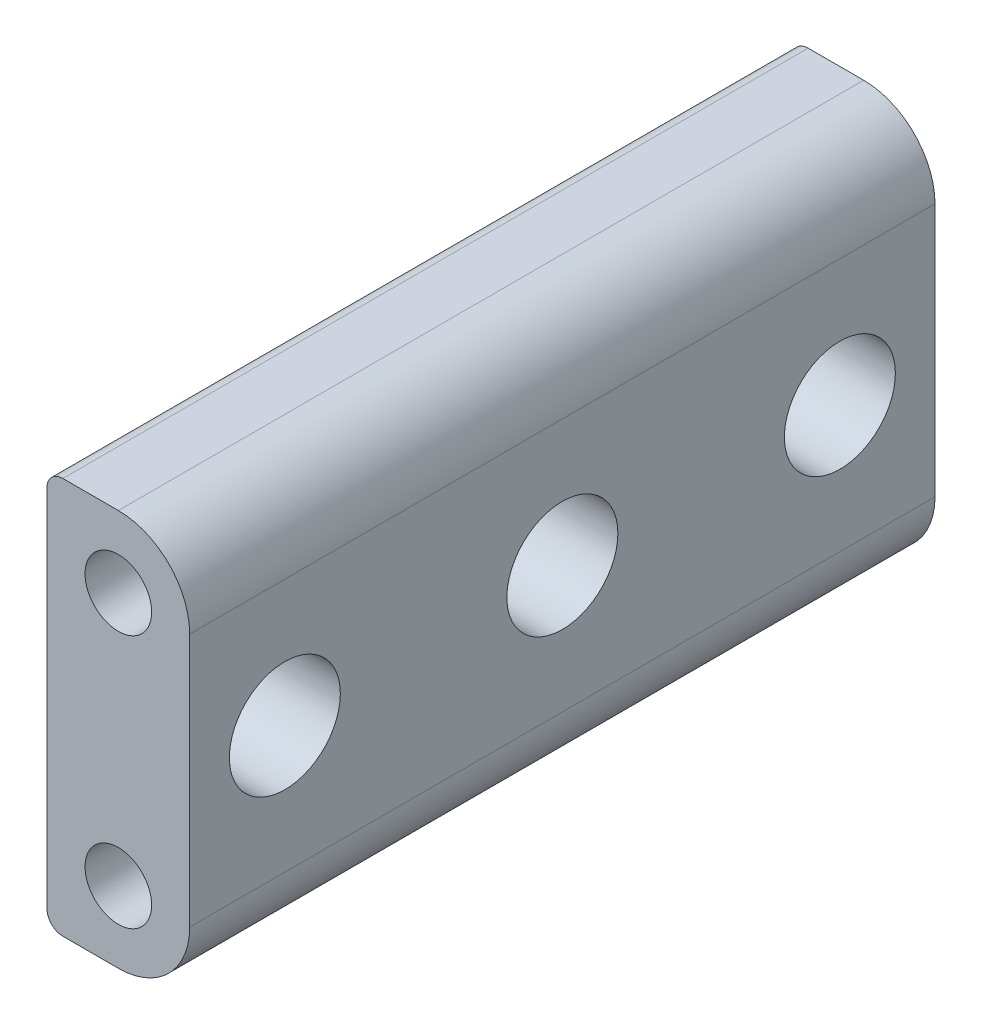
ISO-10303-21;
HEADER;
FILE_DESCRIPTION(('STEP AP214'),'2;1');
FILE_NAME('part.step','',(''),(''),'','','');
FILE_SCHEMA(('AUTOMOTIVE_DESIGN { 1 0 10303 214 1 1 1 1 }'));
ENDSEC;
DATA;
#1=APPLICATION_CONTEXT('core data for automotive mechanical design processes');
#2=APPLICATION_PROTOCOL_DEFINITION('international standard','automotive_design',2000,#1);
#3=PRODUCT_CONTEXT('',#1,'mechanical');
#4=PRODUCT('Part','Part','',(#3));
#5=PRODUCT_RELATED_PRODUCT_CATEGORY('part','',(#4));
#6=PRODUCT_DEFINITION_FORMATION('','',#4);
#7=PRODUCT_DEFINITION_CONTEXT('part definition',#1,'design');
#8=PRODUCT_DEFINITION('design','',#6,#7);
#9=PRODUCT_DEFINITION_SHAPE('','',#8);
#10=(LENGTH_UNIT() NAMED_UNIT(*) SI_UNIT(.MILLI.,.METRE.));
#11=(NAMED_UNIT(*) PLANE_ANGLE_UNIT() SI_UNIT($,.RADIAN.));
#12=(NAMED_UNIT(*) SI_UNIT($,.STERADIAN.) SOLID_ANGLE_UNIT());
#13=UNCERTAINTY_MEASURE_WITH_UNIT(LENGTH_MEASURE(1.E-05),#10,'distance_accuracy_value','');
#14=(GEOMETRIC_REPRESENTATION_CONTEXT(3) GLOBAL_UNCERTAINTY_ASSIGNED_CONTEXT((#13)) GLOBAL_UNIT_ASSIGNED_CONTEXT((#10,
#11,#12)) REPRESENTATION_CONTEXT('',''));
#15=CARTESIAN_POINT('',(0.,0.,0.));
#16=DIRECTION('',(0.,0.,1.));
#17=DIRECTION('',(1.,0.,0.));
#18=AXIS2_PLACEMENT_3D('',#15,#16,#17);
#19=CARTESIAN_POINT('',(0.,16.,47.));
#20=DIRECTION('',(0.,0.,-1.));
#21=DIRECTION('',(-1.,0.,0.));
#22=AXIS2_PLACEMENT_3D('',#19,#20,#21);
#23=CYLINDRICAL_SURFACE('',#22,4.5);
#24=CARTESIAN_POINT('',(0.,16.,0.));
#25=DIRECTION('',(0.,0.,1.));
#26=DIRECTION('',(-1.,0.,0.));
#27=AXIS2_PLACEMENT_3D('',#24,#25,#26);
#28=CIRCLE('',#27,4.5);
#29=CARTESIAN_POINT('',(4.5,16.,0.));
#30=VERTEX_POINT('',#29);
#31=CARTESIAN_POINT('',(0.,20.5,0.));
#32=VERTEX_POINT('',#31);
#33=EDGE_CURVE('E126',#30,#32,#28,.T.);
#34=ORIENTED_EDGE('',*,*,#33,.T.);
#35=DIRECTION('',(0.,0.,-1.));
#36=VECTOR('',#35,1.);
#37=CARTESIAN_POINT('',(0.,20.5,47.));
#38=LINE('',#37,#36);
#39=CARTESIAN_POINT('',(0.,20.5,47.));
#40=VERTEX_POINT('',#39);
#41=EDGE_CURVE('E109',#40,#32,#38,.T.);
#42=ORIENTED_EDGE('',*,*,#41,.F.);
#43=CARTESIAN_POINT('',(0.,16.,47.));
#44=DIRECTION('',(0.,0.,1.));
#45=DIRECTION('',(-1.,0.,0.));
#46=AXIS2_PLACEMENT_3D('',#43,#44,#45);
#47=CIRCLE('',#46,4.5);
#48=CARTESIAN_POINT('',(4.5,16.,47.));
#49=VERTEX_POINT('',#48);
#50=EDGE_CURVE('E114',#49,#40,#47,.T.);
#51=ORIENTED_EDGE('',*,*,#50,.F.);
#52=DIRECTION('',(0.,0.,-1.));
#53=VECTOR('',#52,1.);
#54=CARTESIAN_POINT('',(4.5,16.,47.));
#55=LINE('',#54,#53);
#56=EDGE_CURVE('E176',#49,#30,#55,.T.);
#57=ORIENTED_EDGE('',*,*,#56,.T.);
#58=EDGE_LOOP('',(#34,#42,#51,#57));
#59=FACE_BOUND('',#58,.T.);
#60=ADVANCED_FACE('F41',(#59),#23,.T.);
#61=CARTESIAN_POINT('',(0.,20.5,47.));
#62=DIRECTION('',(0.,-1.,0.));
#63=DIRECTION('',(0.,0.,-1.));
#64=AXIS2_PLACEMENT_3D('',#61,#62,#63);
#65=PLANE('',#64);
#66=DIRECTION('',(-1.,0.,0.));
#67=VECTOR('',#66,1.);
#68=CARTESIAN_POINT('',(0.,20.5,0.));
#69=LINE('',#68,#67);
#70=CARTESIAN_POINT('',(-3.5,20.5,0.));
#71=VERTEX_POINT('',#70);
#72=EDGE_CURVE('E167',#32,#71,#69,.T.);
#73=ORIENTED_EDGE('',*,*,#72,.T.);
#74=DIRECTION('',(0.,0.,-1.));
#75=VECTOR('',#74,1.);
#76=CARTESIAN_POINT('',(-3.5,20.5,47.));
#77=LINE('',#76,#75);
#78=CARTESIAN_POINT('',(-3.5,20.5,47.));
#79=VERTEX_POINT('',#78);
#80=EDGE_CURVE('E12',#71,#79,#77,.F.);
#81=ORIENTED_EDGE('',*,*,#80,.T.);
#82=DIRECTION('',(-1.,0.,0.));
#83=VECTOR('',#82,1.);
#84=CARTESIAN_POINT('',(0.,20.5,47.));
#85=LINE('',#84,#83);
#86=EDGE_CURVE('E105',#40,#79,#85,.T.);
#87=ORIENTED_EDGE('',*,*,#86,.F.);
#88=ORIENTED_EDGE('',*,*,#41,.T.);
#89=EDGE_LOOP('',(#73,#81,#87,#88));
#90=FACE_BOUND('',#89,.T.);
#91=ADVANCED_FACE('F107',(#90),#65,.F.);
#92=CARTESIAN_POINT('',(-4.5,-4.5,47.));
#93=DIRECTION('',(1.,0.,0.));
#94=DIRECTION('',(0.,0.,-1.));
#95=AXIS2_PLACEMENT_3D('',#92,#93,#94);
#96=PLANE('',#95);
#97=DIRECTION('',(0.,-1.,0.));
#98=VECTOR('',#97,1.);
#99=CARTESIAN_POINT('',(-4.5,-4.5,0.));
#100=LINE('',#99,#98);
#101=CARTESIAN_POINT('',(-4.5,19.5,0.));
#102=VERTEX_POINT('',#101);
#103=CARTESIAN_POINT('',(-4.5,-3.5,0.));
#104=VERTEX_POINT('',#103);
#105=EDGE_CURVE('E162',#102,#104,#100,.T.);
#106=ORIENTED_EDGE('',*,*,#105,.T.);
#107=DIRECTION('',(0.,0.,-1.));
#108=VECTOR('',#107,1.);
#109=CARTESIAN_POINT('',(-4.5,-3.5,47.));
#110=LINE('',#109,#108);
#111=CARTESIAN_POINT('',(-4.5,-3.5,47.));
#112=VERTEX_POINT('',#111);
#113=EDGE_CURVE('E62',#104,#112,#110,.F.);
#114=ORIENTED_EDGE('',*,*,#113,.T.);
#115=DIRECTION('',(0.,-1.,0.));
#116=VECTOR('',#115,1.);
#117=CARTESIAN_POINT('',(-4.5,-4.5,47.));
#118=LINE('',#117,#116);
#119=CARTESIAN_POINT('',(-4.5,19.5,47.));
#120=VERTEX_POINT('',#119);
#121=EDGE_CURVE('E113',#120,#112,#118,.T.);
#122=ORIENTED_EDGE('',*,*,#121,.F.);
#123=DIRECTION('',(0.,0.,-1.));
#124=VECTOR('',#123,1.);
#125=CARTESIAN_POINT('',(-4.5,19.5,47.));
#126=LINE('',#125,#124);
#127=EDGE_CURVE('E141',#120,#102,#126,.T.);
#128=ORIENTED_EDGE('',*,*,#127,.T.);
#129=EDGE_LOOP('',(#106,#114,#122,#128));
#130=FACE_BOUND('',#129,.T.);
#131=ADVANCED_FACE('F165',(#130),#96,.F.);
#132=CARTESIAN_POINT('',(0.,-4.5,47.));
#133=DIRECTION('',(0.,1.,0.));
#134=DIRECTION('',(0.,0.,1.));
#135=AXIS2_PLACEMENT_3D('',#132,#133,#134);
#136=PLANE('',#135);
#137=DIRECTION('',(1.,0.,0.));
#138=VECTOR('',#137,1.);
#139=CARTESIAN_POINT('',(0.,-4.5,47.));
#140=LINE('',#139,#138);
#141=CARTESIAN_POINT('',(-3.5,-4.5,47.));
#142=VERTEX_POINT('',#141);
#143=CARTESIAN_POINT('',(0.,-4.5,47.));
#144=VERTEX_POINT('',#143);
#145=EDGE_CURVE('E148',#142,#144,#140,.T.);
#146=ORIENTED_EDGE('',*,*,#145,.F.);
#147=DIRECTION('',(0.,0.,-1.));
#148=VECTOR('',#147,1.);
#149=CARTESIAN_POINT('',(-3.5,-4.5,47.));
#150=LINE('',#149,#148);
#151=CARTESIAN_POINT('',(-3.5,-4.5,0.));
#152=VERTEX_POINT('',#151);
#153=EDGE_CURVE('E127',#142,#152,#150,.T.);
#154=ORIENTED_EDGE('',*,*,#153,.T.);
#155=DIRECTION('',(1.,0.,0.));
#156=VECTOR('',#155,1.);
#157=CARTESIAN_POINT('',(0.,-4.5,0.));
#158=LINE('',#157,#156);
#159=CARTESIAN_POINT('',(0.,-4.5,0.));
#160=VERTEX_POINT('',#159);
#161=EDGE_CURVE('E164',#152,#160,#158,.T.);
#162=ORIENTED_EDGE('',*,*,#161,.T.);
#163=DIRECTION('',(0.,0.,-1.));
#164=VECTOR('',#163,1.);
#165=CARTESIAN_POINT('',(0.,-4.5,47.));
#166=LINE('',#165,#164);
#167=EDGE_CURVE('E128',#144,#160,#166,.T.);
#168=ORIENTED_EDGE('',*,*,#167,.F.);
#169=EDGE_LOOP('',(#146,#154,#162,#168));
#170=FACE_BOUND('',#169,.T.);
#171=ADVANCED_FACE('F153',(#170),#136,.F.);
#172=CARTESIAN_POINT('',(0.,0.,47.));
#173=DIRECTION('',(0.,0.,-1.));
#174=DIRECTION('',(-1.,0.,0.));
#175=AXIS2_PLACEMENT_3D('',#172,#173,#174);
#176=CYLINDRICAL_SURFACE('',#175,4.5);
#177=CARTESIAN_POINT('',(0.,0.,0.));
#178=DIRECTION('',(0.,0.,1.));
#179=DIRECTION('',(1.,0.,0.));
#180=AXIS2_PLACEMENT_3D('',#177,#178,#179);
#181=CIRCLE('',#180,4.5);
#182=CARTESIAN_POINT('',(4.5,0.,0.));
#183=VERTEX_POINT('',#182);
#184=EDGE_CURVE('E169',#160,#183,#181,.T.);
#185=ORIENTED_EDGE('',*,*,#184,.T.);
#186=DIRECTION('',(0.,0.,-1.));
#187=VECTOR('',#186,1.);
#188=CARTESIAN_POINT('',(4.5,0.,47.));
#189=LINE('',#188,#187);
#190=CARTESIAN_POINT('',(4.5,0.,47.));
#191=VERTEX_POINT('',#190);
#192=EDGE_CURVE('E134',#191,#183,#189,.T.);
#193=ORIENTED_EDGE('',*,*,#192,.F.);
#194=CARTESIAN_POINT('',(0.,0.,47.));
#195=DIRECTION('',(0.,0.,1.));
#196=DIRECTION('',(1.,0.,0.));
#197=AXIS2_PLACEMENT_3D('',#194,#195,#196);
#198=CIRCLE('',#197,4.5);
#199=EDGE_CURVE('E156',#144,#191,#198,.T.);
#200=ORIENTED_EDGE('',*,*,#199,.F.);
#201=ORIENTED_EDGE('',*,*,#167,.T.);
#202=EDGE_LOOP('',(#185,#193,#200,#201));
#203=FACE_BOUND('',#202,.T.);
#204=ADVANCED_FACE('F241',(#203),#176,.T.);
#205=CARTESIAN_POINT('',(4.5,0.,47.));
#206=DIRECTION('',(-1.,0.,0.));
#207=DIRECTION('',(0.,0.,1.));
#208=AXIS2_PLACEMENT_3D('',#205,#206,#207);
#209=PLANE('',#208);
#210=CARTESIAN_POINT('',(4.5,8.,41.));
#211=DIRECTION('',(1.,0.,0.));
#212=DIRECTION('',(0.,0.,-1.));
#213=AXIS2_PLACEMENT_3D('',#210,#211,#212);
#214=CIRCLE('',#213,3.5);
#215=CARTESIAN_POINT('',(4.5,8.,37.5));
#216=VERTEX_POINT('',#215);
#217=EDGE_CURVE('E224',#216,#216,#214,.T.);
#218=ORIENTED_EDGE('',*,*,#217,.F.);
#219=EDGE_LOOP('',(#218));
#220=FACE_BOUND('',#219,.T.);
#221=CARTESIAN_POINT('',(4.5,8.,23.5));
#222=DIRECTION('',(1.,0.,0.));
#223=DIRECTION('',(0.,0.,-1.));
#224=AXIS2_PLACEMENT_3D('',#221,#222,#223);
#225=CIRCLE('',#224,3.5);
#226=CARTESIAN_POINT('',(4.5,8.,20.));
#227=VERTEX_POINT('',#226);
#228=EDGE_CURVE('E221',#227,#227,#225,.T.);
#229=ORIENTED_EDGE('',*,*,#228,.F.);
#230=EDGE_LOOP('',(#229));
#231=FACE_BOUND('',#230,.T.);
#232=CARTESIAN_POINT('',(4.5,8.,6.));
#233=DIRECTION('',(1.,0.,0.));
#234=DIRECTION('',(0.,0.,-1.));
#235=AXIS2_PLACEMENT_3D('',#232,#233,#234);
#236=CIRCLE('',#235,3.5);
#237=CARTESIAN_POINT('',(4.5,8.,2.5));
#238=VERTEX_POINT('',#237);
#239=EDGE_CURVE('E215',#238,#238,#236,.T.);
#240=ORIENTED_EDGE('',*,*,#239,.F.);
#241=EDGE_LOOP('',(#240));
#242=FACE_BOUND('',#241,.T.);
#243=DIRECTION('',(0.,1.,0.));
#244=VECTOR('',#243,1.);
#245=CARTESIAN_POINT('',(4.5,0.,0.));
#246=LINE('',#245,#244);
#247=EDGE_CURVE('E123',#183,#30,#246,.T.);
#248=ORIENTED_EDGE('',*,*,#247,.T.);
#249=ORIENTED_EDGE('',*,*,#56,.F.);
#250=DIRECTION('',(0.,1.,0.));
#251=VECTOR('',#250,1.);
#252=CARTESIAN_POINT('',(4.5,0.,47.));
#253=LINE('',#252,#251);
#254=EDGE_CURVE('E119',#191,#49,#253,.T.);
#255=ORIENTED_EDGE('',*,*,#254,.F.);
#256=ORIENTED_EDGE('',*,*,#192,.T.);
#257=EDGE_LOOP('',(#248,#249,#255,#256));
#258=FACE_BOUND('',#257,.T.);
#259=ADVANCED_FACE('F181',(#220,#231,#242,#258),#209,.F.);
#260=CARTESIAN_POINT('',(0.,16.,47.));
#261=DIRECTION('',(0.,0.,-1.));
#262=DIRECTION('',(-1.,0.,0.));
#263=AXIS2_PLACEMENT_3D('',#260,#261,#262);
#264=PLANE('',#263);
#265=CARTESIAN_POINT('',(0.,16.,47.));
#266=DIRECTION('',(0.,0.,1.));
#267=DIRECTION('',(1.,0.,0.));
#268=AXIS2_PLACEMENT_3D('',#265,#266,#267);
#269=CIRCLE('',#268,2.1);
#270=CARTESIAN_POINT('',(2.1,16.,47.));
#271=VERTEX_POINT('',#270);
#272=EDGE_CURVE('E185',#271,#271,#269,.T.);
#273=ORIENTED_EDGE('',*,*,#272,.F.);
#274=EDGE_LOOP('',(#273));
#275=FACE_BOUND('',#274,.T.);
#276=CARTESIAN_POINT('',(0.,0.,47.));
#277=DIRECTION('',(0.,0.,1.));
#278=DIRECTION('',(1.,0.,0.));
#279=AXIS2_PLACEMENT_3D('',#276,#277,#278);
#280=CIRCLE('',#279,2.1);
#281=CARTESIAN_POINT('',(2.1,0.,47.));
#282=VERTEX_POINT('',#281);
#283=EDGE_CURVE('E194',#282,#282,#280,.T.);
#284=ORIENTED_EDGE('',*,*,#283,.F.);
#285=EDGE_LOOP('',(#284));
#286=FACE_BOUND('',#285,.T.);
#287=ORIENTED_EDGE('',*,*,#121,.T.);
#288=CARTESIAN_POINT('',(-3.5,-3.5,47.));
#289=DIRECTION('',(0.,0.,-1.));
#290=DIRECTION('',(-1.,0.,0.));
#291=AXIS2_PLACEMENT_3D('',#288,#289,#290);
#292=CIRCLE('',#291,1.);
#293=EDGE_CURVE('E49',#112,#142,#292,.F.);
#294=ORIENTED_EDGE('',*,*,#293,.T.);
#295=ORIENTED_EDGE('',*,*,#145,.T.);
#296=ORIENTED_EDGE('',*,*,#199,.T.);
#297=ORIENTED_EDGE('',*,*,#254,.T.);
#298=ORIENTED_EDGE('',*,*,#50,.T.);
#299=ORIENTED_EDGE('',*,*,#86,.T.);
#300=CARTESIAN_POINT('',(-3.5,19.5,47.));
#301=DIRECTION('',(0.,0.,-1.));
#302=DIRECTION('',(-1.,0.,0.));
#303=AXIS2_PLACEMENT_3D('',#300,#301,#302);
#304=CIRCLE('',#303,1.);
#305=EDGE_CURVE('E145',#79,#120,#304,.F.);
#306=ORIENTED_EDGE('',*,*,#305,.T.);
#307=EDGE_LOOP('',(#287,#294,#295,#296,#297,#298,#299,#306));
#308=FACE_BOUND('',#307,.T.);
#309=ADVANCED_FACE('F117',(#275,#286,#308),#264,.F.);
#310=CARTESIAN_POINT('',(0.,16.,0.));
#311=DIRECTION('',(0.,0.,-1.));
#312=DIRECTION('',(-1.,0.,0.));
#313=AXIS2_PLACEMENT_3D('',#310,#311,#312);
#314=PLANE('',#313);
#315=CARTESIAN_POINT('',(0.,0.,0.));
#316=DIRECTION('',(0.,0.,-1.));
#317=DIRECTION('',(-1.,0.,0.));
#318=AXIS2_PLACEMENT_3D('',#315,#316,#317);
#319=CIRCLE('',#318,2.1);
#320=CARTESIAN_POINT('',(-2.1,0.,0.));
#321=VERTEX_POINT('',#320);
#322=EDGE_CURVE('E207',#321,#321,#319,.T.);
#323=ORIENTED_EDGE('',*,*,#322,.F.);
#324=EDGE_LOOP('',(#323));
#325=FACE_BOUND('',#324,.T.);
#326=CARTESIAN_POINT('',(0.,16.,0.));
#327=DIRECTION('',(0.,0.,-1.));
#328=DIRECTION('',(-1.,0.,0.));
#329=AXIS2_PLACEMENT_3D('',#326,#327,#328);
#330=CIRCLE('',#329,2.1);
#331=CARTESIAN_POINT('',(-2.1,16.,0.));
#332=VERTEX_POINT('',#331);
#333=EDGE_CURVE('E203',#332,#332,#330,.T.);
#334=ORIENTED_EDGE('',*,*,#333,.F.);
#335=EDGE_LOOP('',(#334));
#336=FACE_BOUND('',#335,.T.);
#337=ORIENTED_EDGE('',*,*,#161,.F.);
#338=CARTESIAN_POINT('',(-3.5,-3.5,0.));
#339=DIRECTION('',(0.,0.,-1.));
#340=DIRECTION('',(-1.,0.,0.));
#341=AXIS2_PLACEMENT_3D('',#338,#339,#340);
#342=CIRCLE('',#341,1.);
#343=EDGE_CURVE('E139',#152,#104,#342,.T.);
#344=ORIENTED_EDGE('',*,*,#343,.T.);
#345=ORIENTED_EDGE('',*,*,#105,.F.);
#346=CARTESIAN_POINT('',(-3.5,19.5,0.));
#347=DIRECTION('',(0.,0.,-1.));
#348=DIRECTION('',(-1.,0.,0.));
#349=AXIS2_PLACEMENT_3D('',#346,#347,#348);
#350=CIRCLE('',#349,1.);
#351=EDGE_CURVE('E131',#102,#71,#350,.T.);
#352=ORIENTED_EDGE('',*,*,#351,.T.);
#353=ORIENTED_EDGE('',*,*,#72,.F.);
#354=ORIENTED_EDGE('',*,*,#33,.F.);
#355=ORIENTED_EDGE('',*,*,#247,.F.);
#356=ORIENTED_EDGE('',*,*,#184,.F.);
#357=EDGE_LOOP('',(#337,#344,#345,#352,#353,#354,#355,#356));
#358=FACE_BOUND('',#357,.T.);
#359=ADVANCED_FACE('F161',(#325,#336,#358),#314,.T.);
#360=CARTESIAN_POINT('',(0.,0.,43.));
#361=DIRECTION('',(0.,0.,1.));
#362=DIRECTION('',(1.,0.,0.));
#363=AXIS2_PLACEMENT_3D('',#360,#361,#362);
#364=CYLINDRICAL_SURFACE('',#363,2.1);
#365=CARTESIAN_POINT('',(0.,0.,43.));
#366=DIRECTION('',(0.,0.,1.));
#367=DIRECTION('',(1.,0.,0.));
#368=AXIS2_PLACEMENT_3D('',#365,#366,#367);
#369=CIRCLE('',#368,2.1);
#370=CARTESIAN_POINT('',(2.1,0.,43.));
#371=VERTEX_POINT('',#370);
#372=EDGE_CURVE('E191',#371,#371,#369,.T.);
#373=ORIENTED_EDGE('',*,*,#372,.F.);
#374=EDGE_LOOP('',(#373));
#375=FACE_BOUND('',#374,.T.);
#376=ORIENTED_EDGE('',*,*,#283,.T.);
#377=EDGE_LOOP('',(#376));
#378=FACE_BOUND('',#377,.T.);
#379=ADVANCED_FACE('F386',(#375,#378),#364,.F.);
#380=CARTESIAN_POINT('',(0.,0.,43.));
#381=DIRECTION('',(0.,0.,1.));
#382=DIRECTION('',(1.,0.,0.));
#383=AXIS2_PLACEMENT_3D('',#380,#381,#382);
#384=PLANE('',#383);
#385=ORIENTED_EDGE('',*,*,#372,.T.);
#386=EDGE_LOOP('',(#385));
#387=FACE_BOUND('',#386,.T.);
#388=ADVANCED_FACE('F377',(#387),#384,.T.);
#389=CARTESIAN_POINT('',(0.,16.,43.));
#390=DIRECTION('',(0.,0.,1.));
#391=DIRECTION('',(1.,0.,0.));
#392=AXIS2_PLACEMENT_3D('',#389,#390,#391);
#393=CYLINDRICAL_SURFACE('',#392,2.1);
#394=CARTESIAN_POINT('',(0.,16.,43.));
#395=DIRECTION('',(0.,0.,1.));
#396=DIRECTION('',(1.,0.,0.));
#397=AXIS2_PLACEMENT_3D('',#394,#395,#396);
#398=CIRCLE('',#397,2.1);
#399=CARTESIAN_POINT('',(2.1,16.,43.));
#400=VERTEX_POINT('',#399);
#401=EDGE_CURVE('E183',#400,#400,#398,.T.);
#402=ORIENTED_EDGE('',*,*,#401,.F.);
#403=EDGE_LOOP('',(#402));
#404=FACE_BOUND('',#403,.T.);
#405=ORIENTED_EDGE('',*,*,#272,.T.);
#406=EDGE_LOOP('',(#405));
#407=FACE_BOUND('',#406,.T.);
#408=ADVANCED_FACE('F368',(#404,#407),#393,.F.);
#409=CARTESIAN_POINT('',(0.,16.,43.));
#410=DIRECTION('',(0.,0.,1.));
#411=DIRECTION('',(1.,0.,0.));
#412=AXIS2_PLACEMENT_3D('',#409,#410,#411);
#413=PLANE('',#412);
#414=ORIENTED_EDGE('',*,*,#401,.T.);
#415=EDGE_LOOP('',(#414));
#416=FACE_BOUND('',#415,.T.);
#417=ADVANCED_FACE('F359',(#416),#413,.T.);
#418=CARTESIAN_POINT('',(0.,16.,4.));
#419=DIRECTION('',(0.,0.,-1.));
#420=DIRECTION('',(-1.,0.,0.));
#421=AXIS2_PLACEMENT_3D('',#418,#419,#420);
#422=CYLINDRICAL_SURFACE('',#421,2.1);
#423=CARTESIAN_POINT('',(0.,16.,4.));
#424=DIRECTION('',(0.,0.,-1.));
#425=DIRECTION('',(-1.,0.,0.));
#426=AXIS2_PLACEMENT_3D('',#423,#424,#425);
#427=CIRCLE('',#426,2.1);
#428=CARTESIAN_POINT('',(-2.1,16.,4.));
#429=VERTEX_POINT('',#428);
#430=EDGE_CURVE('E200',#429,#429,#427,.T.);
#431=ORIENTED_EDGE('',*,*,#430,.F.);
#432=EDGE_LOOP('',(#431));
#433=FACE_BOUND('',#432,.T.);
#434=ORIENTED_EDGE('',*,*,#333,.T.);
#435=EDGE_LOOP('',(#434));
#436=FACE_BOUND('',#435,.T.);
#437=ADVANCED_FACE('F350',(#433,#436),#422,.F.);
#438=CARTESIAN_POINT('',(0.,16.,4.));
#439=DIRECTION('',(0.,0.,-1.));
#440=DIRECTION('',(-1.,0.,0.));
#441=AXIS2_PLACEMENT_3D('',#438,#439,#440);
#442=PLANE('',#441);
#443=ORIENTED_EDGE('',*,*,#430,.T.);
#444=EDGE_LOOP('',(#443));
#445=FACE_BOUND('',#444,.T.);
#446=ADVANCED_FACE('F341',(#445),#442,.T.);
#447=CARTESIAN_POINT('',(0.,0.,4.));
#448=DIRECTION('',(0.,0.,-1.));
#449=DIRECTION('',(-1.,0.,0.));
#450=AXIS2_PLACEMENT_3D('',#447,#448,#449);
#451=CYLINDRICAL_SURFACE('',#450,2.1);
#452=CARTESIAN_POINT('',(0.,0.,4.));
#453=DIRECTION('',(0.,0.,-1.));
#454=DIRECTION('',(-1.,0.,0.));
#455=AXIS2_PLACEMENT_3D('',#452,#453,#454);
#456=CIRCLE('',#455,2.1);
#457=CARTESIAN_POINT('',(-2.1,0.,4.));
#458=VERTEX_POINT('',#457);
#459=EDGE_CURVE('E195',#458,#458,#456,.T.);
#460=ORIENTED_EDGE('',*,*,#459,.F.);
#461=EDGE_LOOP('',(#460));
#462=FACE_BOUND('',#461,.T.);
#463=ORIENTED_EDGE('',*,*,#322,.T.);
#464=EDGE_LOOP('',(#463));
#465=FACE_BOUND('',#464,.T.);
#466=ADVANCED_FACE('F260',(#462,#465),#451,.F.);
#467=CARTESIAN_POINT('',(0.,0.,4.));
#468=DIRECTION('',(0.,0.,-1.));
#469=DIRECTION('',(-1.,0.,0.));
#470=AXIS2_PLACEMENT_3D('',#467,#468,#469);
#471=PLANE('',#470);
#472=ORIENTED_EDGE('',*,*,#459,.T.);
#473=EDGE_LOOP('',(#472));
#474=FACE_BOUND('',#473,.T.);
#475=ADVANCED_FACE('F250',(#474),#471,.T.);
#476=CARTESIAN_POINT('',(-0.5,8.,6.));
#477=DIRECTION('',(1.,0.,0.));
#478=DIRECTION('',(0.,0.,-1.));
#479=AXIS2_PLACEMENT_3D('',#476,#477,#478);
#480=CYLINDRICAL_SURFACE('',#479,3.5);
#481=CARTESIAN_POINT('',(-0.5,8.,6.));
#482=DIRECTION('',(1.,0.,0.));
#483=DIRECTION('',(0.,0.,-1.));
#484=AXIS2_PLACEMENT_3D('',#481,#482,#483);
#485=CIRCLE('',#484,3.5);
#486=CARTESIAN_POINT('',(-0.5,8.,2.5));
#487=VERTEX_POINT('',#486);
#488=EDGE_CURVE('E212',#487,#487,#485,.T.);
#489=ORIENTED_EDGE('',*,*,#488,.F.);
#490=EDGE_LOOP('',(#489));
#491=FACE_BOUND('',#490,.T.);
#492=ORIENTED_EDGE('',*,*,#239,.T.);
#493=EDGE_LOOP('',(#492));
#494=FACE_BOUND('',#493,.T.);
#495=ADVANCED_FACE('F247',(#491,#494),#480,.F.);
#496=CARTESIAN_POINT('',(-0.5,8.,6.));
#497=DIRECTION('',(1.,0.,0.));
#498=DIRECTION('',(0.,0.,-1.));
#499=AXIS2_PLACEMENT_3D('',#496,#497,#498);
#500=PLANE('',#499);
#501=ORIENTED_EDGE('',*,*,#488,.T.);
#502=EDGE_LOOP('',(#501));
#503=FACE_BOUND('',#502,.T.);
#504=ADVANCED_FACE('F249',(#503),#500,.T.);
#505=CARTESIAN_POINT('',(-0.5,8.,23.5));
#506=DIRECTION('',(1.,0.,0.));
#507=DIRECTION('',(0.,0.,-1.));
#508=AXIS2_PLACEMENT_3D('',#505,#506,#507);
#509=CYLINDRICAL_SURFACE('',#508,3.5);
#510=CARTESIAN_POINT('',(-0.5,8.,23.5));
#511=DIRECTION('',(1.,0.,0.));
#512=DIRECTION('',(0.,0.,-1.));
#513=AXIS2_PLACEMENT_3D('',#510,#511,#512);
#514=CIRCLE('',#513,3.5);
#515=CARTESIAN_POINT('',(-0.5,8.,20.));
#516=VERTEX_POINT('',#515);
#517=EDGE_CURVE('E218',#516,#516,#514,.T.);
#518=ORIENTED_EDGE('',*,*,#517,.F.);
#519=EDGE_LOOP('',(#518));
#520=FACE_BOUND('',#519,.T.);
#521=ORIENTED_EDGE('',*,*,#228,.T.);
#522=EDGE_LOOP('',(#521));
#523=FACE_BOUND('',#522,.T.);
#524=ADVANCED_FACE('F256',(#520,#523),#509,.F.);
#525=CARTESIAN_POINT('',(-0.5,8.,23.5));
#526=DIRECTION('',(1.,0.,0.));
#527=DIRECTION('',(0.,0.,-1.));
#528=AXIS2_PLACEMENT_3D('',#525,#526,#527);
#529=PLANE('',#528);
#530=ORIENTED_EDGE('',*,*,#517,.T.);
#531=EDGE_LOOP('',(#530));
#532=FACE_BOUND('',#531,.T.);
#533=ADVANCED_FACE('F235',(#532),#529,.T.);
#534=CARTESIAN_POINT('',(-0.5,8.,41.));
#535=DIRECTION('',(1.,0.,0.));
#536=DIRECTION('',(0.,0.,-1.));
#537=AXIS2_PLACEMENT_3D('',#534,#535,#536);
#538=CYLINDRICAL_SURFACE('',#537,3.5);
#539=CARTESIAN_POINT('',(-0.5,8.,41.));
#540=DIRECTION('',(1.,0.,0.));
#541=DIRECTION('',(0.,0.,-1.));
#542=AXIS2_PLACEMENT_3D('',#539,#540,#541);
#543=CIRCLE('',#542,3.5);
#544=CARTESIAN_POINT('',(-0.5,8.,37.5));
#545=VERTEX_POINT('',#544);
#546=EDGE_CURVE('E204',#545,#545,#543,.T.);
#547=ORIENTED_EDGE('',*,*,#546,.F.);
#548=EDGE_LOOP('',(#547));
#549=FACE_BOUND('',#548,.T.);
#550=ORIENTED_EDGE('',*,*,#217,.T.);
#551=EDGE_LOOP('',(#550));
#552=FACE_BOUND('',#551,.T.);
#553=ADVANCED_FACE('F232',(#549,#552),#538,.F.);
#554=CARTESIAN_POINT('',(-0.5,8.,41.));
#555=DIRECTION('',(1.,0.,0.));
#556=DIRECTION('',(0.,0.,-1.));
#557=AXIS2_PLACEMENT_3D('',#554,#555,#556);
#558=PLANE('',#557);
#559=ORIENTED_EDGE('',*,*,#546,.T.);
#560=EDGE_LOOP('',(#559));
#561=FACE_BOUND('',#560,.T.);
#562=ADVANCED_FACE('F230',(#561),#558,.T.);
#563=CARTESIAN_POINT('',(-3.5,-3.5,47.));
#564=DIRECTION('',(0.,0.,-1.));
#565=DIRECTION('',(-1.,0.,0.));
#566=AXIS2_PLACEMENT_3D('',#563,#564,#565);
#567=CYLINDRICAL_SURFACE('',#566,1.);
#568=ORIENTED_EDGE('',*,*,#293,.F.);
#569=ORIENTED_EDGE('',*,*,#113,.F.);
#570=ORIENTED_EDGE('',*,*,#343,.F.);
#571=ORIENTED_EDGE('',*,*,#153,.F.);
#572=EDGE_LOOP('',(#568,#569,#570,#571));
#573=FACE_BOUND('',#572,.T.);
#574=ADVANCED_FACE('F158',(#573),#567,.T.);
#575=CARTESIAN_POINT('',(-3.5,19.5,47.));
#576=DIRECTION('',(0.,0.,-1.));
#577=DIRECTION('',(-1.,0.,0.));
#578=AXIS2_PLACEMENT_3D('',#575,#576,#577);
#579=CYLINDRICAL_SURFACE('',#578,1.);
#580=ORIENTED_EDGE('',*,*,#305,.F.);
#581=ORIENTED_EDGE('',*,*,#80,.F.);
#582=ORIENTED_EDGE('',*,*,#351,.F.);
#583=ORIENTED_EDGE('',*,*,#127,.F.);
#584=EDGE_LOOP('',(#580,#581,#582,#583));
#585=FACE_BOUND('',#584,.T.);
#586=ADVANCED_FACE('F43',(#585),#579,.T.);
#587=CLOSED_SHELL('',(#60,#91,#131,#171,#204,#259,#309,#359,#379,#388,#408,#417,#437,#446,#466,
#475,#495,#504,#524,#533,#553,#562,#574,#586));
#588=MANIFOLD_SOLID_BREP('B2',#587);
#589=ADVANCED_BREP_SHAPE_REPRESENTATION('',(#18,#588),#14);
#590=SHAPE_DEFINITION_REPRESENTATION(#9,#589);
ENDSEC;
END-ISO-10303-21;
